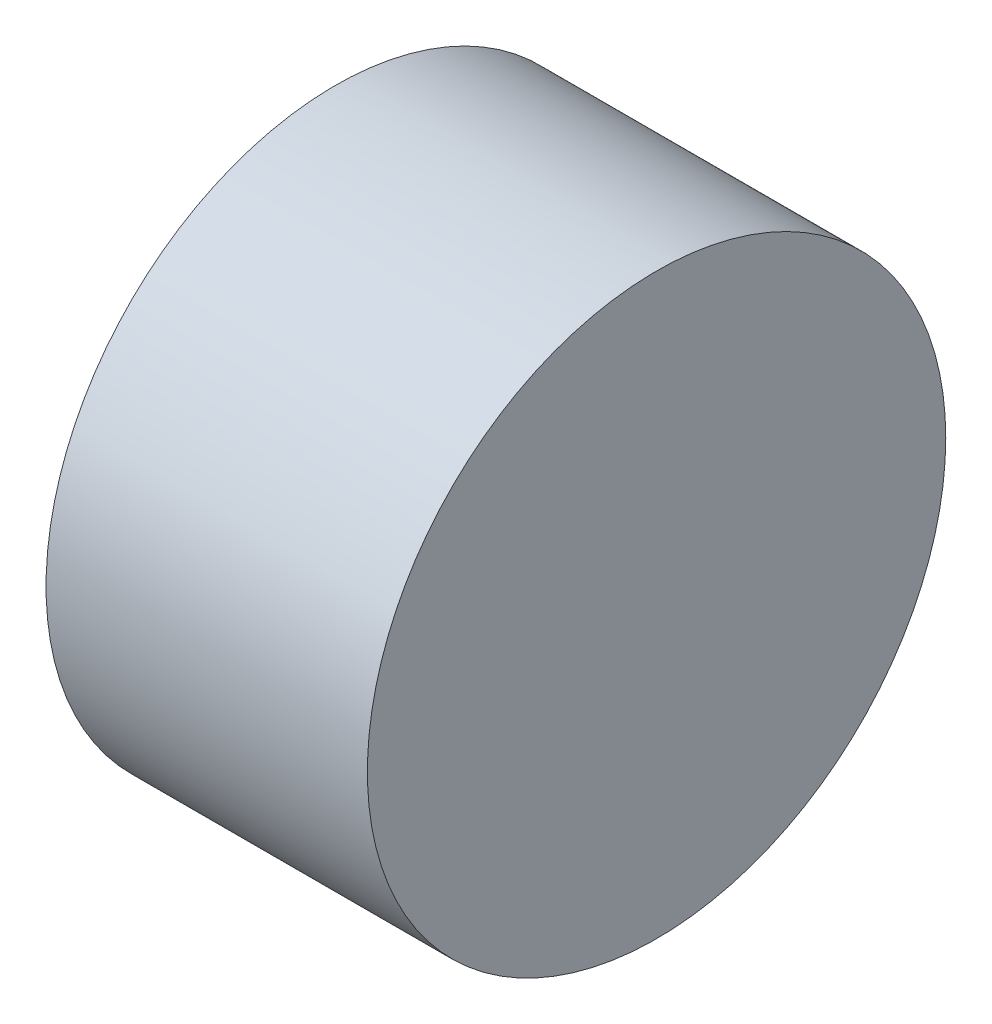
ISO-10303-21;
HEADER;
FILE_DESCRIPTION(('STEP AP214'),'2;1');
FILE_NAME('part.step','',(''),(''),'','','');
FILE_SCHEMA(('AUTOMOTIVE_DESIGN { 1 0 10303 214 1 1 1 1 }'));
ENDSEC;
DATA;
#1=APPLICATION_CONTEXT('core data for automotive mechanical design processes');
#2=APPLICATION_PROTOCOL_DEFINITION('international standard','automotive_design',2000,#1);
#3=PRODUCT_CONTEXT('',#1,'mechanical');
#4=PRODUCT('Part','Part','',(#3));
#5=PRODUCT_RELATED_PRODUCT_CATEGORY('part','',(#4));
#6=PRODUCT_DEFINITION_FORMATION('','',#4);
#7=PRODUCT_DEFINITION_CONTEXT('part definition',#1,'design');
#8=PRODUCT_DEFINITION('design','',#6,#7);
#9=PRODUCT_DEFINITION_SHAPE('','',#8);
#10=(LENGTH_UNIT() NAMED_UNIT(*) SI_UNIT(.MILLI.,.METRE.));
#11=(NAMED_UNIT(*) PLANE_ANGLE_UNIT() SI_UNIT($,.RADIAN.));
#12=(NAMED_UNIT(*) SI_UNIT($,.STERADIAN.) SOLID_ANGLE_UNIT());
#13=UNCERTAINTY_MEASURE_WITH_UNIT(LENGTH_MEASURE(1.E-05),#10,'distance_accuracy_value','');
#14=(GEOMETRIC_REPRESENTATION_CONTEXT(3) GLOBAL_UNCERTAINTY_ASSIGNED_CONTEXT((#13)) GLOBAL_UNIT_ASSIGNED_CONTEXT((#10,
#11,#12)) REPRESENTATION_CONTEXT('',''));
#15=CARTESIAN_POINT('',(0.,0.,0.));
#16=DIRECTION('',(0.,0.,1.));
#17=DIRECTION('',(1.,0.,0.));
#18=AXIS2_PLACEMENT_3D('',#15,#16,#17);
#19=CARTESIAN_POINT('',(3.766666666667,-3.6,15.424059202831));
#20=DIRECTION('',(1.,0.,0.));
#21=DIRECTION('',(0.,0.,-1.));
#22=AXIS2_PLACEMENT_3D('',#19,#20,#21);
#23=PLANE('',#22);
#24=CARTESIAN_POINT('',(3.766666666667,-3.6,15.424059202831));
#25=DIRECTION('',(1.,0.,0.));
#26=DIRECTION('',(0.,0.,-1.));
#27=AXIS2_PLACEMENT_3D('',#24,#25,#26);
#28=CIRCLE('',#27,0.3);
#29=CARTESIAN_POINT('',(3.766666666667,-3.6,15.124059202831));
#30=VERTEX_POINT('',#29);
#31=EDGE_CURVE('E18',#30,#30,#28,.F.);
#32=ORIENTED_EDGE('',*,*,#31,.F.);
#33=EDGE_LOOP('',(#32));
#34=FACE_BOUND('',#33,.T.);
#35=ADVANCED_FACE('F15',(#34),#23,.T.);
#36=CARTESIAN_POINT('',(3.433333333333,-3.6,15.424059202831));
#37=DIRECTION('',(1.,0.,0.));
#38=DIRECTION('',(0.,0.,-1.));
#39=AXIS2_PLACEMENT_3D('',#36,#37,#38);
#40=PLANE('',#39);
#41=CARTESIAN_POINT('',(3.433333333333,-3.6,15.424059202831));
#42=DIRECTION('',(1.,0.,0.));
#43=DIRECTION('',(0.,0.,-1.));
#44=AXIS2_PLACEMENT_3D('',#41,#42,#43);
#45=CIRCLE('',#44,0.3);
#46=CARTESIAN_POINT('',(3.433333333333,-3.6,15.124059202831));
#47=VERTEX_POINT('',#46);
#48=EDGE_CURVE('E10',#47,#47,#45,.T.);
#49=ORIENTED_EDGE('',*,*,#48,.F.);
#50=EDGE_LOOP('',(#49));
#51=FACE_BOUND('',#50,.T.);
#52=ADVANCED_FACE('F33',(#51),#40,.F.);
#53=CARTESIAN_POINT('',(3.433333333333,-3.6,15.424059202831));
#54=DIRECTION('',(1.,0.,0.));
#55=DIRECTION('',(0.,0.,-1.));
#56=AXIS2_PLACEMENT_3D('',#53,#54,#55);
#57=CYLINDRICAL_SURFACE('',#56,0.3);
#58=ORIENTED_EDGE('',*,*,#48,.T.);
#59=EDGE_LOOP('',(#58));
#60=FACE_BOUND('',#59,.T.);
#61=ORIENTED_EDGE('',*,*,#31,.T.);
#62=EDGE_LOOP('',(#61));
#63=FACE_BOUND('',#62,.T.);
#64=ADVANCED_FACE('F30',(#60,#63),#57,.T.);
#65=CLOSED_SHELL('',(#35,#52,#64));
#66=MANIFOLD_SOLID_BREP('B1',#65);
#67=ADVANCED_BREP_SHAPE_REPRESENTATION('',(#18,#66),#14);
#68=SHAPE_DEFINITION_REPRESENTATION(#9,#67);
ENDSEC;
END-ISO-10303-21;
